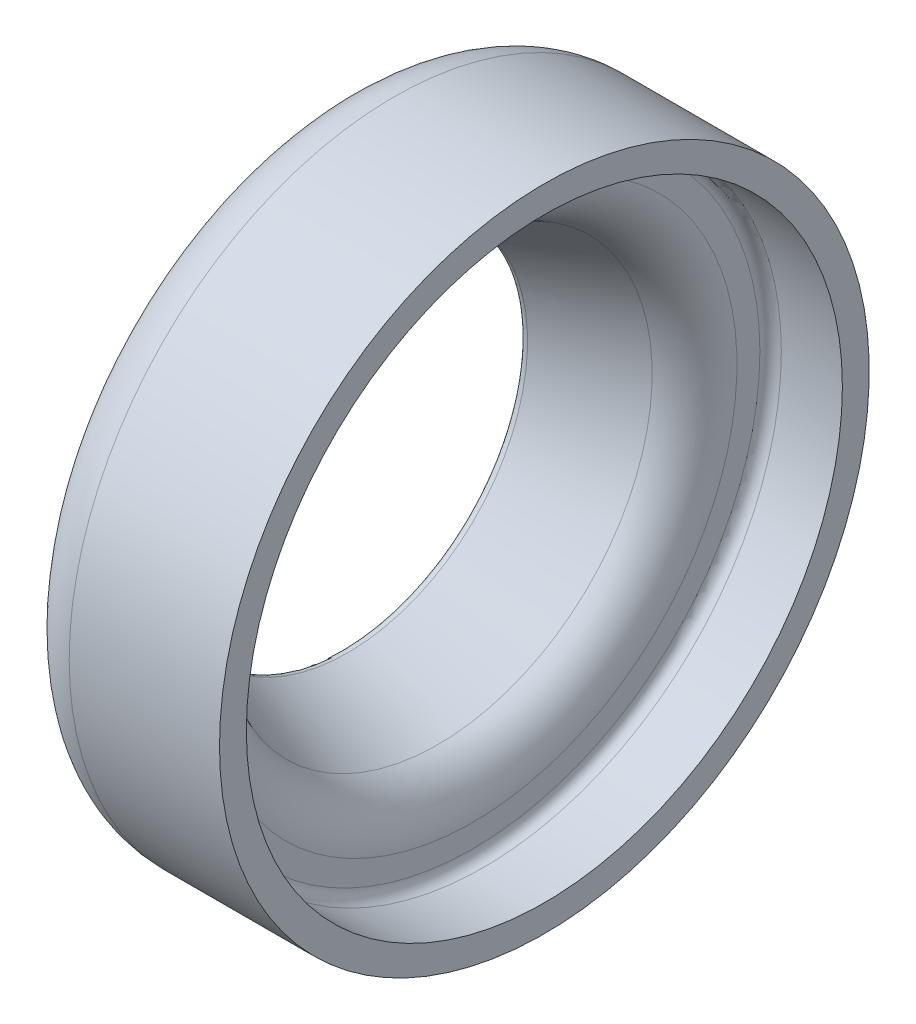
ISO-10303-21;
HEADER;
FILE_DESCRIPTION(('STEP AP214'),'2;1');
FILE_NAME('part.step','',(''),(''),'','','');
FILE_SCHEMA(('AUTOMOTIVE_DESIGN { 1 0 10303 214 1 1 1 1 }'));
ENDSEC;
DATA;
#1=APPLICATION_CONTEXT('core data for automotive mechanical design processes');
#2=APPLICATION_PROTOCOL_DEFINITION('international standard','automotive_design',2000,#1);
#3=PRODUCT_CONTEXT('',#1,'mechanical');
#4=PRODUCT('Part','Part','',(#3));
#5=PRODUCT_RELATED_PRODUCT_CATEGORY('part','',(#4));
#6=PRODUCT_DEFINITION_FORMATION('','',#4);
#7=PRODUCT_DEFINITION_CONTEXT('part definition',#1,'design');
#8=PRODUCT_DEFINITION('design','',#6,#7);
#9=PRODUCT_DEFINITION_SHAPE('','',#8);
#10=(LENGTH_UNIT() NAMED_UNIT(*) SI_UNIT(.MILLI.,.METRE.));
#11=(NAMED_UNIT(*) PLANE_ANGLE_UNIT() SI_UNIT($,.RADIAN.));
#12=(NAMED_UNIT(*) SI_UNIT($,.STERADIAN.) SOLID_ANGLE_UNIT());
#13=UNCERTAINTY_MEASURE_WITH_UNIT(LENGTH_MEASURE(1.E-05),#10,'distance_accuracy_value','');
#14=(GEOMETRIC_REPRESENTATION_CONTEXT(3) GLOBAL_UNCERTAINTY_ASSIGNED_CONTEXT((#13)) GLOBAL_UNIT_ASSIGNED_CONTEXT((#10,
#11,#12)) REPRESENTATION_CONTEXT('',''));
#15=CARTESIAN_POINT('',(0.,0.,0.));
#16=DIRECTION('',(0.,0.,1.));
#17=DIRECTION('',(1.,0.,0.));
#18=AXIS2_PLACEMENT_3D('',#15,#16,#17);
#19=CARTESIAN_POINT('',(10.,0.,0.));
#20=DIRECTION('',(-1.,0.,0.));
#21=DIRECTION('',(0.,0.,1.));
#22=AXIS2_PLACEMENT_3D('',#19,#20,#21);
#23=TOROIDAL_SURFACE('',#22,50.5217757734967,10.);
#24=CARTESIAN_POINT('',(0.,0.,0.));
#25=DIRECTION('',(-1.,0.,0.));
#26=DIRECTION('',(0.,0.,1.));
#27=AXIS2_PLACEMENT_3D('',#24,#25,#26);
#28=CIRCLE('',#27,50.5217757734967);
#29=CARTESIAN_POINT('',(0.,0.,50.5217757734967));
#30=VERTEX_POINT('',#29);
#31=EDGE_CURVE('E90',#30,#30,#28,.T.);
#32=ORIENTED_EDGE('',*,*,#31,.F.);
#33=EDGE_LOOP('',(#32));
#34=FACE_BOUND('',#33,.T.);
#35=CARTESIAN_POINT('',(10.,0.,0.));
#36=DIRECTION('',(-1.,0.,0.));
#37=DIRECTION('',(0.,0.,1.));
#38=AXIS2_PLACEMENT_3D('',#35,#36,#37);
#39=CIRCLE('',#38,60.5217757734967);
#40=CARTESIAN_POINT('',(10.,0.,60.5217757734967));
#41=VERTEX_POINT('',#40);
#42=EDGE_CURVE('E63',#41,#41,#39,.T.);
#43=ORIENTED_EDGE('',*,*,#42,.T.);
#44=EDGE_LOOP('',(#43));
#45=FACE_BOUND('',#44,.T.);
#46=ADVANCED_FACE('F36',(#34,#45),#23,.T.);
#47=CARTESIAN_POINT('',(0.,0.,0.));
#48=DIRECTION('',(-1.,0.,0.));
#49=DIRECTION('',(0.,0.,1.));
#50=AXIS2_PLACEMENT_3D('',#47,#48,#49);
#51=CYLINDRICAL_SURFACE('',#50,60.5217757734967);
#52=ORIENTED_EDGE('',*,*,#42,.F.);
#53=EDGE_LOOP('',(#52));
#54=FACE_BOUND('',#53,.T.);
#55=CARTESIAN_POINT('',(38.,0.,0.));
#56=DIRECTION('',(-1.,0.,0.));
#57=DIRECTION('',(0.,0.,1.));
#58=AXIS2_PLACEMENT_3D('',#55,#56,#57);
#59=CIRCLE('',#58,60.5217757734967);
#60=CARTESIAN_POINT('',(38.,0.,60.5217757734967));
#61=VERTEX_POINT('',#60);
#62=EDGE_CURVE('E66',#61,#61,#59,.T.);
#63=ORIENTED_EDGE('',*,*,#62,.T.);
#64=EDGE_LOOP('',(#63));
#65=FACE_BOUND('',#64,.T.);
#66=ADVANCED_FACE('F98',(#54,#65),#51,.T.);
#67=CARTESIAN_POINT('',(38.,60.5217757734967,0.));
#68=DIRECTION('',(-1.,0.,0.));
#69=DIRECTION('',(0.,0.,1.));
#70=AXIS2_PLACEMENT_3D('',#67,#68,#69);
#71=PLANE('',#70);
#72=ORIENTED_EDGE('',*,*,#62,.F.);
#73=EDGE_LOOP('',(#72));
#74=FACE_BOUND('',#73,.T.);
#75=CARTESIAN_POINT('',(38.,0.,0.));
#76=DIRECTION('',(-1.,0.,0.));
#77=DIRECTION('',(0.,0.,1.));
#78=AXIS2_PLACEMENT_3D('',#75,#76,#77);
#79=CIRCLE('',#78,55.5217757734967);
#80=CARTESIAN_POINT('',(38.,0.,55.5217757734967));
#81=VERTEX_POINT('',#80);
#82=EDGE_CURVE('E69',#81,#81,#79,.T.);
#83=ORIENTED_EDGE('',*,*,#82,.T.);
#84=EDGE_LOOP('',(#83));
#85=FACE_BOUND('',#84,.T.);
#86=ADVANCED_FACE('F104',(#74,#85),#71,.F.);
#87=CARTESIAN_POINT('',(0.,0.,0.));
#88=DIRECTION('',(-1.,0.,0.));
#89=DIRECTION('',(0.,0.,1.));
#90=AXIS2_PLACEMENT_3D('',#87,#88,#89);
#91=CYLINDRICAL_SURFACE('',#90,55.5217757734967);
#92=ORIENTED_EDGE('',*,*,#82,.F.);
#93=EDGE_LOOP('',(#92));
#94=FACE_BOUND('',#93,.T.);
#95=CARTESIAN_POINT('',(26.6314003694729,0.,0.));
#96=DIRECTION('',(-1.,0.,0.));
#97=DIRECTION('',(0.,0.,1.));
#98=AXIS2_PLACEMENT_3D('',#95,#96,#97);
#99=CIRCLE('',#98,55.5217757734967);
#100=CARTESIAN_POINT('',(26.6314003694729,0.,55.5217757734967));
#101=VERTEX_POINT('',#100);
#102=EDGE_CURVE('E72',#101,#101,#99,.T.);
#103=ORIENTED_EDGE('',*,*,#102,.T.);
#104=EDGE_LOOP('',(#103));
#105=FACE_BOUND('',#104,.T.);
#106=ADVANCED_FACE('F110',(#94,#105),#91,.F.);
#107=CARTESIAN_POINT('',(26.6314003694729,0.,0.));
#108=DIRECTION('',(-1.,0.,0.));
#109=DIRECTION('',(0.,0.,1.));
#110=AXIS2_PLACEMENT_3D('',#107,#108,#109);
#111=TOROIDAL_SURFACE('',#110,53.5217757734967,2.);
#112=ORIENTED_EDGE('',*,*,#102,.F.);
#113=EDGE_LOOP('',(#112));
#114=FACE_BOUND('',#113,.T.);
#115=CARTESIAN_POINT('',(24.6314003694729,0.,0.));
#116=DIRECTION('',(-1.,0.,0.));
#117=DIRECTION('',(0.,0.,1.));
#118=AXIS2_PLACEMENT_3D('',#115,#116,#117);
#119=CIRCLE('',#118,53.5217757734967);
#120=CARTESIAN_POINT('',(24.6314003694729,0.,53.5217757734967));
#121=VERTEX_POINT('',#120);
#122=EDGE_CURVE('E75',#121,#121,#119,.T.);
#123=ORIENTED_EDGE('',*,*,#122,.T.);
#124=EDGE_LOOP('',(#123));
#125=FACE_BOUND('',#124,.T.);
#126=ADVANCED_FACE('F116',(#114,#125),#111,.F.);
#127=CARTESIAN_POINT('',(24.6314003694729,53.5217757734967,0.));
#128=DIRECTION('',(-1.,0.,0.));
#129=DIRECTION('',(0.,0.,1.));
#130=AXIS2_PLACEMENT_3D('',#127,#128,#129);
#131=PLANE('',#130);
#132=ORIENTED_EDGE('',*,*,#122,.F.);
#133=EDGE_LOOP('',(#132));
#134=FACE_BOUND('',#133,.T.);
#135=CARTESIAN_POINT('',(24.6314003694729,0.,0.));
#136=DIRECTION('',(-1.,0.,0.));
#137=DIRECTION('',(0.,0.,1.));
#138=AXIS2_PLACEMENT_3D('',#135,#136,#137);
#139=CIRCLE('',#138,49.2527393752609);
#140=CARTESIAN_POINT('',(24.6314003694729,0.,49.2527393752609));
#141=VERTEX_POINT('',#140);
#142=EDGE_CURVE('E78',#141,#141,#139,.T.);
#143=ORIENTED_EDGE('',*,*,#142,.T.);
#144=EDGE_LOOP('',(#143));
#145=FACE_BOUND('',#144,.T.);
#146=ADVANCED_FACE('F122',(#134,#145),#131,.F.);
#147=CARTESIAN_POINT('',(14.6314003694729,0.,0.));
#148=DIRECTION('',(-1.,0.,0.));
#149=DIRECTION('',(0.,0.,1.));
#150=AXIS2_PLACEMENT_3D('',#147,#148,#149);
#151=TOROIDAL_SURFACE('',#150,49.2527393752609,10.);
#152=ORIENTED_EDGE('',*,*,#142,.F.);
#153=EDGE_LOOP('',(#152));
#154=FACE_BOUND('',#153,.T.);
#155=CARTESIAN_POINT('',(18.1813961408853,0.,0.));
#156=DIRECTION('',(-1.,0.,0.));
#157=DIRECTION('',(0.,0.,1.));
#158=AXIS2_PLACEMENT_3D('',#155,#156,#157);
#159=CIRCLE('',#158,39.9040747635126);
#160=CARTESIAN_POINT('',(18.1813961408853,0.,39.9040747635126));
#161=VERTEX_POINT('',#160);
#162=EDGE_CURVE('E81',#161,#161,#159,.T.);
#163=ORIENTED_EDGE('',*,*,#162,.T.);
#164=EDGE_LOOP('',(#163));
#165=FACE_BOUND('',#164,.T.);
#166=ADVANCED_FACE('F128',(#154,#165),#151,.T.);
#167=CARTESIAN_POINT('',(1.35499957714123,0.,0.));
#168=DIRECTION('',(1.,0.,0.));
#169=DIRECTION('',(0.,0.,-1.));
#170=AXIS2_PLACEMENT_3D('',#167,#168,#169);
#171=CONICAL_SURFACE('',#170,33.5145379547654,0.362913614950881);
#172=ORIENTED_EDGE('',*,*,#162,.F.);
#173=EDGE_LOOP('',(#172));
#174=FACE_BOUND('',#173,.T.);
#175=CARTESIAN_POINT('',(1.35499957714123,0.,0.));
#176=DIRECTION('',(-1.,0.,0.));
#177=DIRECTION('',(0.,0.,1.));
#178=AXIS2_PLACEMENT_3D('',#175,#176,#177);
#179=CIRCLE('',#178,33.5145379547654);
#180=CARTESIAN_POINT('',(1.35499957714123,0.,33.5145379547654));
#181=VERTEX_POINT('',#180);
#182=EDGE_CURVE('E84',#181,#181,#179,.T.);
#183=ORIENTED_EDGE('',*,*,#182,.T.);
#184=EDGE_LOOP('',(#183));
#185=FACE_BOUND('',#184,.T.);
#186=ADVANCED_FACE('F134',(#174,#185),#171,.F.);
#187=CARTESIAN_POINT('',(1.,0.,0.));
#188=DIRECTION('',(-1.,0.,0.));
#189=DIRECTION('',(0.,0.,1.));
#190=AXIS2_PLACEMENT_3D('',#187,#188,#189);
#191=TOROIDAL_SURFACE('',#190,34.4494044159403,1.);
#192=ORIENTED_EDGE('',*,*,#182,.F.);
#193=EDGE_LOOP('',(#192));
#194=FACE_BOUND('',#193,.T.);
#195=CARTESIAN_POINT('',(0.,0.,0.));
#196=DIRECTION('',(-1.,0.,0.));
#197=DIRECTION('',(0.,0.,1.));
#198=AXIS2_PLACEMENT_3D('',#195,#196,#197);
#199=CIRCLE('',#198,34.4494044159403);
#200=CARTESIAN_POINT('',(0.,0.,34.4494044159403));
#201=VERTEX_POINT('',#200);
#202=EDGE_CURVE('E87',#201,#201,#199,.T.);
#203=ORIENTED_EDGE('',*,*,#202,.T.);
#204=EDGE_LOOP('',(#203));
#205=FACE_BOUND('',#204,.T.);
#206=ADVANCED_FACE('F140',(#194,#205),#191,.T.);
#207=CARTESIAN_POINT('',(0.,34.4494044159403,0.));
#208=DIRECTION('',(1.,0.,0.));
#209=DIRECTION('',(0.,0.,-1.));
#210=AXIS2_PLACEMENT_3D('',#207,#208,#209);
#211=PLANE('',#210);
#212=ORIENTED_EDGE('',*,*,#202,.F.);
#213=EDGE_LOOP('',(#212));
#214=FACE_BOUND('',#213,.T.);
#215=ORIENTED_EDGE('',*,*,#31,.T.);
#216=EDGE_LOOP('',(#215));
#217=FACE_BOUND('',#216,.T.);
#218=ADVANCED_FACE('F94',(#214,#217),#211,.F.);
#219=CLOSED_SHELL('',(#46,#66,#86,#106,#126,#146,#166,#186,#206,#218));
#220=CARTESIAN_POINT('',(13.,0.,0.));
#221=DIRECTION('',(-1.,0.,0.));
#222=DIRECTION('',(0.,0.,1.));
#223=AXIS2_PLACEMENT_3D('',#220,#221,#222);
#224=TOROIDAL_SURFACE('',#223,45.5217757734967,10.);
#225=CARTESIAN_POINT('',(3.,0.,0.));
#226=DIRECTION('',(-1.,0.,0.));
#227=DIRECTION('',(0.,0.,1.));
#228=AXIS2_PLACEMENT_3D('',#225,#226,#227);
#229=CIRCLE('',#228,45.5217757734967);
#230=CARTESIAN_POINT('',(3.,0.,45.5217757734967));
#231=VERTEX_POINT('',#230);
#232=EDGE_CURVE('E10',#231,#231,#229,.T.);
#233=ORIENTED_EDGE('',*,*,#232,.T.);
#234=EDGE_LOOP('',(#233));
#235=FACE_BOUND('',#234,.T.);
#236=CARTESIAN_POINT('',(13.,0.,0.));
#237=DIRECTION('',(-1.,0.,0.));
#238=DIRECTION('',(0.,0.,1.));
#239=AXIS2_PLACEMENT_3D('',#236,#237,#238);
#240=CIRCLE('',#239,55.5217757734967);
#241=CARTESIAN_POINT('',(13.,0.,55.5217757734967));
#242=VERTEX_POINT('',#241);
#243=EDGE_CURVE('E60',#242,#242,#240,.T.);
#244=ORIENTED_EDGE('',*,*,#243,.F.);
#245=EDGE_LOOP('',(#244));
#246=FACE_BOUND('',#245,.T.);
#247=ADVANCED_FACE('F38',(#235,#246),#224,.F.);
#248=CARTESIAN_POINT('',(3.,45.5217757734967,0.));
#249=DIRECTION('',(1.,0.,0.));
#250=DIRECTION('',(0.,0.,-1.));
#251=AXIS2_PLACEMENT_3D('',#248,#249,#250);
#252=PLANE('',#251);
#253=CARTESIAN_POINT('',(3.,0.,0.));
#254=DIRECTION('',(-1.,0.,0.));
#255=DIRECTION('',(0.,0.,1.));
#256=AXIS2_PLACEMENT_3D('',#253,#254,#255);
#257=CIRCLE('',#256,36.1598477471439);
#258=CARTESIAN_POINT('',(3.,0.,36.1598477471439));
#259=VERTEX_POINT('',#258);
#260=EDGE_CURVE('E44',#259,#259,#257,.T.);
#261=ORIENTED_EDGE('',*,*,#260,.T.);
#262=EDGE_LOOP('',(#261));
#263=FACE_BOUND('',#262,.T.);
#264=ORIENTED_EDGE('',*,*,#232,.F.);
#265=EDGE_LOOP('',(#264));
#266=FACE_BOUND('',#265,.T.);
#267=ADVANCED_FACE('F170',(#263,#266),#252,.T.);
#268=CARTESIAN_POINT('',(3.,0.,0.));
#269=DIRECTION('',(1.,0.,0.));
#270=DIRECTION('',(0.,0.,-1.));
#271=AXIS2_PLACEMENT_3D('',#268,#269,#270);
#272=CONICAL_SURFACE('',#271,36.1598477471439,0.350727948248203);
#273=CARTESIAN_POINT('',(15.0672156821083,0.,0.));
#274=DIRECTION('',(-1.,0.,0.));
#275=DIRECTION('',(0.,0.,1.));
#276=AXIS2_PLACEMENT_3D('',#273,#274,#275);
#277=CIRCLE('',#276,40.5746827527933);
#278=CARTESIAN_POINT('',(15.0672156821083,0.,40.5746827527933));
#279=VERTEX_POINT('',#278);
#280=EDGE_CURVE('E48',#279,#279,#277,.T.);
#281=ORIENTED_EDGE('',*,*,#280,.T.);
#282=EDGE_LOOP('',(#281));
#283=FACE_BOUND('',#282,.T.);
#284=ORIENTED_EDGE('',*,*,#260,.F.);
#285=EDGE_LOOP('',(#284));
#286=FACE_BOUND('',#285,.T.);
#287=ADVANCED_FACE('F167',(#283,#286),#272,.T.);
#288=CARTESIAN_POINT('',(11.6314003694729,0.,0.));
#289=DIRECTION('',(-1.,0.,0.));
#290=DIRECTION('',(0.,0.,1.));
#291=AXIS2_PLACEMENT_3D('',#288,#289,#290);
#292=TOROIDAL_SURFACE('',#291,49.9659112739965,10.);
#293=CARTESIAN_POINT('',(21.6314003694729,0.,0.));
#294=DIRECTION('',(-1.,0.,0.));
#295=DIRECTION('',(0.,0.,1.));
#296=AXIS2_PLACEMENT_3D('',#293,#294,#295);
#297=CIRCLE('',#296,49.9659112739965);
#298=CARTESIAN_POINT('',(21.6314003694729,0.,49.9659112739965));
#299=VERTEX_POINT('',#298);
#300=EDGE_CURVE('E52',#299,#299,#297,.T.);
#301=ORIENTED_EDGE('',*,*,#300,.T.);
#302=EDGE_LOOP('',(#301));
#303=FACE_BOUND('',#302,.T.);
#304=ORIENTED_EDGE('',*,*,#280,.F.);
#305=EDGE_LOOP('',(#304));
#306=FACE_BOUND('',#305,.T.);
#307=ADVANCED_FACE('F163',(#303,#306),#292,.F.);
#308=CARTESIAN_POINT('',(21.6314003694729,49.9659112739965,0.));
#309=DIRECTION('',(-1.,0.,0.));
#310=DIRECTION('',(0.,0.,1.));
#311=AXIS2_PLACEMENT_3D('',#308,#309,#310);
#312=PLANE('',#311);
#313=CARTESIAN_POINT('',(21.6314003694729,0.,0.));
#314=DIRECTION('',(-1.,0.,0.));
#315=DIRECTION('',(0.,0.,1.));
#316=AXIS2_PLACEMENT_3D('',#313,#314,#315);
#317=CIRCLE('',#316,55.5217757734967);
#318=CARTESIAN_POINT('',(21.6314003694729,0.,55.5217757734967));
#319=VERTEX_POINT('',#318);
#320=EDGE_CURVE('E57',#319,#319,#317,.T.);
#321=ORIENTED_EDGE('',*,*,#320,.T.);
#322=EDGE_LOOP('',(#321));
#323=FACE_BOUND('',#322,.T.);
#324=ORIENTED_EDGE('',*,*,#300,.F.);
#325=EDGE_LOOP('',(#324));
#326=FACE_BOUND('',#325,.T.);
#327=ADVANCED_FACE('F158',(#323,#326),#312,.T.);
#328=CARTESIAN_POINT('',(0.,0.,0.));
#329=DIRECTION('',(-1.,0.,0.));
#330=DIRECTION('',(0.,0.,1.));
#331=AXIS2_PLACEMENT_3D('',#328,#329,#330);
#332=CYLINDRICAL_SURFACE('',#331,55.5217757734967);
#333=ORIENTED_EDGE('',*,*,#243,.T.);
#334=EDGE_LOOP('',(#333));
#335=FACE_BOUND('',#334,.T.);
#336=ORIENTED_EDGE('',*,*,#320,.F.);
#337=EDGE_LOOP('',(#336));
#338=FACE_BOUND('',#337,.T.);
#339=ADVANCED_FACE('F155',(#335,#338),#332,.F.);
#340=CLOSED_SHELL('',(#247,#267,#287,#307,#327,#339));
#341=ORIENTED_CLOSED_SHELL('',*,#340,.T.);
#342=BREP_WITH_VOIDS('B2',#219,(#341));
#343=ADVANCED_BREP_SHAPE_REPRESENTATION('',(#18,#342),#14);
#344=SHAPE_DEFINITION_REPRESENTATION(#9,#343);
ENDSEC;
END-ISO-10303-21;
